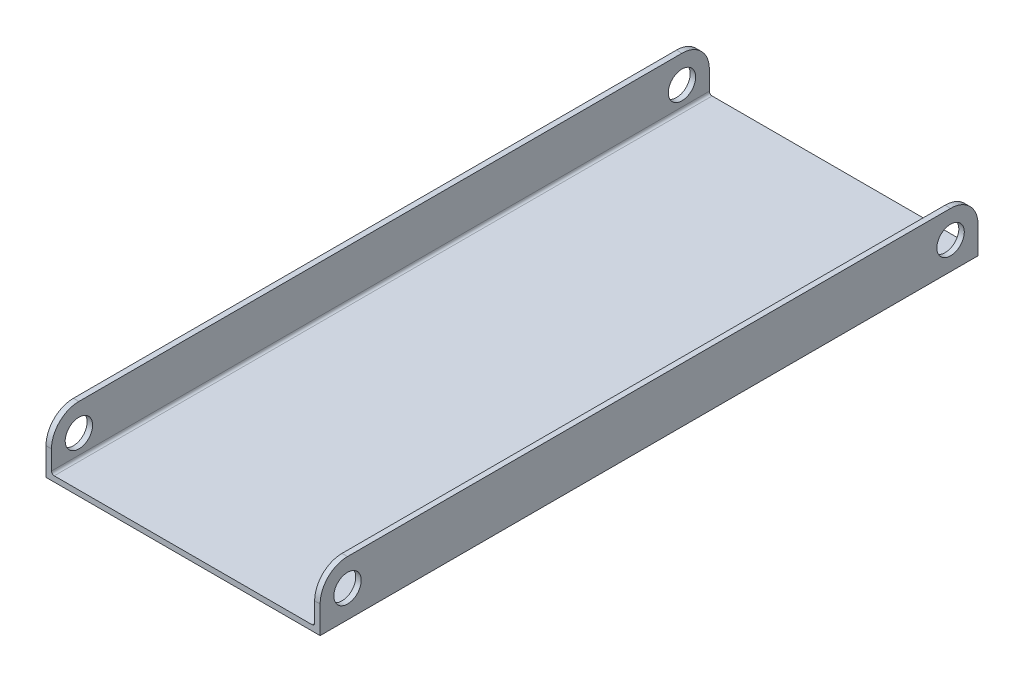
ISO-10303-21;
HEADER;
FILE_DESCRIPTION(('STEP AP214'),'2;1');
FILE_NAME('part.step','',(''),(''),'','','');
FILE_SCHEMA(('AUTOMOTIVE_DESIGN { 1 0 10303 214 1 1 1 1 }'));
ENDSEC;
DATA;
#1=APPLICATION_CONTEXT('core data for automotive mechanical design processes');
#2=APPLICATION_PROTOCOL_DEFINITION('international standard','automotive_design',2000,#1);
#3=PRODUCT_CONTEXT('',#1,'mechanical');
#4=PRODUCT('Part','Part','',(#3));
#5=PRODUCT_RELATED_PRODUCT_CATEGORY('part','',(#4));
#6=PRODUCT_DEFINITION_FORMATION('','',#4);
#7=PRODUCT_DEFINITION_CONTEXT('part definition',#1,'design');
#8=PRODUCT_DEFINITION('design','',#6,#7);
#9=PRODUCT_DEFINITION_SHAPE('','',#8);
#10=(LENGTH_UNIT() NAMED_UNIT(*) SI_UNIT(.MILLI.,.METRE.));
#11=(NAMED_UNIT(*) PLANE_ANGLE_UNIT() SI_UNIT($,.RADIAN.));
#12=(NAMED_UNIT(*) SI_UNIT($,.STERADIAN.) SOLID_ANGLE_UNIT());
#13=UNCERTAINTY_MEASURE_WITH_UNIT(LENGTH_MEASURE(1.E-05),#10,'distance_accuracy_value','');
#14=(GEOMETRIC_REPRESENTATION_CONTEXT(3) GLOBAL_UNCERTAINTY_ASSIGNED_CONTEXT((#13)) GLOBAL_UNIT_ASSIGNED_CONTEXT((#10,
#11,#12)) REPRESENTATION_CONTEXT('',''));
#15=CARTESIAN_POINT('',(0.,0.,0.));
#16=DIRECTION('',(0.,0.,1.));
#17=DIRECTION('',(1.,0.,0.));
#18=AXIS2_PLACEMENT_3D('',#15,#16,#17);
#19=CARTESIAN_POINT('',(-30.48,11.43,-152.4));
#20=DIRECTION('',(0.,1.,0.));
#21=DIRECTION('',(0.,0.,1.));
#22=AXIS2_PLACEMENT_3D('',#19,#20,#21);
#23=PLANE('',#22);
#24=DIRECTION('',(0.,0.,1.));
#25=VECTOR('',#24,1.);
#26=CARTESIAN_POINT('',(-30.48,11.43,-152.4));
#27=LINE('',#26,#25);
#28=CARTESIAN_POINT('',(-30.48,11.43,-146.05));
#29=VERTEX_POINT('',#28);
#30=CARTESIAN_POINT('',(-30.48,11.43,-6.35000000000005));
#31=VERTEX_POINT('',#30);
#32=EDGE_CURVE('E231',#29,#31,#27,.T.);
#33=ORIENTED_EDGE('',*,*,#32,.F.);
#34=DIRECTION('',(-1.,0.,0.));
#35=VECTOR('',#34,1.);
#36=CARTESIAN_POINT('',(-31.75,11.43,-146.05));
#37=LINE('',#36,#35);
#38=CARTESIAN_POINT('',(-31.75,11.43,-146.05));
#39=VERTEX_POINT('',#38);
#40=EDGE_CURVE('E288',#29,#39,#37,.T.);
#41=ORIENTED_EDGE('',*,*,#40,.T.);
#42=DIRECTION('',(0.,0.,1.));
#43=VECTOR('',#42,1.);
#44=CARTESIAN_POINT('',(-31.75,11.43,-152.4));
#45=LINE('',#44,#43);
#46=CARTESIAN_POINT('',(-31.75,11.43,-6.35000000000005));
#47=VERTEX_POINT('',#46);
#48=EDGE_CURVE('E172',#39,#47,#45,.T.);
#49=ORIENTED_EDGE('',*,*,#48,.T.);
#50=DIRECTION('',(-1.,0.,0.));
#51=VECTOR('',#50,1.);
#52=CARTESIAN_POINT('',(-30.48,11.43,-6.34999999999999));
#53=LINE('',#52,#51);
#54=EDGE_CURVE('E285',#47,#31,#53,.F.);
#55=ORIENTED_EDGE('',*,*,#54,.T.);
#56=EDGE_LOOP('',(#33,#41,#49,#55));
#57=FACE_BOUND('',#56,.T.);
#58=ADVANCED_FACE('F45',(#57),#23,.T.);
#59=CARTESIAN_POINT('',(-30.48,11.43,-152.4));
#60=DIRECTION('',(1.,0.,0.));
#61=DIRECTION('',(0.,0.,-1.));
#62=AXIS2_PLACEMENT_3D('',#59,#60,#61);
#63=PLANE('',#62);
#64=CARTESIAN_POINT('',(-30.48,5.07999999999997,-6.35));
#65=DIRECTION('',(1.,0.,0.));
#66=DIRECTION('',(0.,0.,-1.));
#67=AXIS2_PLACEMENT_3D('',#64,#65,#66);
#68=CIRCLE('',#67,3.175);
#69=CARTESIAN_POINT('',(-30.48,5.07999999999997,-9.525));
#70=VERTEX_POINT('',#69);
#71=EDGE_CURVE('E207',#70,#70,#68,.T.);
#72=ORIENTED_EDGE('',*,*,#71,.F.);
#73=EDGE_LOOP('',(#72));
#74=FACE_BOUND('',#73,.T.);
#75=CARTESIAN_POINT('',(-30.48,5.07999999999997,-146.05));
#76=DIRECTION('',(1.,0.,0.));
#77=DIRECTION('',(0.,0.,-1.));
#78=AXIS2_PLACEMENT_3D('',#75,#76,#77);
#79=CIRCLE('',#78,3.17500000000002);
#80=CARTESIAN_POINT('',(-30.48,5.07999999999997,-149.225));
#81=VERTEX_POINT('',#80);
#82=EDGE_CURVE('E414',#81,#81,#79,.T.);
#83=ORIENTED_EDGE('',*,*,#82,.F.);
#84=EDGE_LOOP('',(#83));
#85=FACE_BOUND('',#84,.T.);
#86=DIRECTION('',(0.,1.,0.));
#87=VECTOR('',#86,1.);
#88=CARTESIAN_POINT('',(-30.48,11.43,-152.4));
#89=LINE('',#88,#87);
#90=CARTESIAN_POINT('',(-30.48,0.635000000000005,-152.4));
#91=VERTEX_POINT('',#90);
#92=CARTESIAN_POINT('',(-30.48,5.08,-152.4));
#93=VERTEX_POINT('',#92);
#94=EDGE_CURVE('E200',#91,#93,#89,.T.);
#95=ORIENTED_EDGE('',*,*,#94,.T.);
#96=CARTESIAN_POINT('',(-30.48,5.08,-146.05));
#97=DIRECTION('',(1.,0.,0.));
#98=DIRECTION('',(0.,0.,-1.));
#99=AXIS2_PLACEMENT_3D('',#96,#97,#98);
#100=CIRCLE('',#99,6.35);
#101=EDGE_CURVE('E298',#93,#29,#100,.T.);
#102=ORIENTED_EDGE('',*,*,#101,.T.);
#103=ORIENTED_EDGE('',*,*,#32,.T.);
#104=CARTESIAN_POINT('',(-30.48,5.08,-6.35));
#105=DIRECTION('',(1.,0.,0.));
#106=DIRECTION('',(0.,0.,-1.));
#107=AXIS2_PLACEMENT_3D('',#104,#105,#106);
#108=CIRCLE('',#107,6.35);
#109=CARTESIAN_POINT('',(-30.48,5.08,0.));
#110=VERTEX_POINT('',#109);
#111=EDGE_CURVE('E61',#31,#110,#108,.T.);
#112=ORIENTED_EDGE('',*,*,#111,.T.);
#113=DIRECTION('',(0.,1.,0.));
#114=VECTOR('',#113,1.);
#115=CARTESIAN_POINT('',(-30.48,11.43,0.));
#116=LINE('',#115,#114);
#117=CARTESIAN_POINT('',(-30.48,0.635000000000005,0.));
#118=VERTEX_POINT('',#117);
#119=EDGE_CURVE('E163',#118,#110,#116,.T.);
#120=ORIENTED_EDGE('',*,*,#119,.F.);
#121=DIRECTION('',(0.,0.,1.));
#122=VECTOR('',#121,1.);
#123=CARTESIAN_POINT('',(-30.48,0.635000000000005,-152.4));
#124=LINE('',#123,#122);
#125=EDGE_CURVE('E235',#91,#118,#124,.T.);
#126=ORIENTED_EDGE('',*,*,#125,.F.);
#127=EDGE_LOOP('',(#95,#102,#103,#112,#120,#126));
#128=FACE_BOUND('',#127,.T.);
#129=ADVANCED_FACE('F321',(#74,#85,#128),#63,.T.);
#130=CARTESIAN_POINT('',(-29.845,0.635,-152.4));
#131=DIRECTION('',(0.,0.,1.));
#132=DIRECTION('',(1.,0.,0.));
#133=AXIS2_PLACEMENT_3D('',#130,#131,#132);
#134=CYLINDRICAL_SURFACE('',#133,0.635);
#135=CARTESIAN_POINT('',(-29.845,0.635,0.));
#136=DIRECTION('',(0.,0.,-1.));
#137=DIRECTION('',(1.,0.,0.));
#138=AXIS2_PLACEMENT_3D('',#135,#136,#137);
#139=CIRCLE('',#138,0.635);
#140=CARTESIAN_POINT('',(-29.845,0.,0.));
#141=VERTEX_POINT('',#140);
#142=EDGE_CURVE('E225',#141,#118,#139,.T.);
#143=ORIENTED_EDGE('',*,*,#142,.F.);
#144=DIRECTION('',(0.,0.,1.));
#145=VECTOR('',#144,1.);
#146=CARTESIAN_POINT('',(-29.845,0.,-152.4));
#147=LINE('',#146,#145);
#148=CARTESIAN_POINT('',(-29.845,0.,-152.4));
#149=VERTEX_POINT('',#148);
#150=EDGE_CURVE('E238',#149,#141,#147,.T.);
#151=ORIENTED_EDGE('',*,*,#150,.F.);
#152=CARTESIAN_POINT('',(-29.845,0.635,-152.4));
#153=DIRECTION('',(0.,0.,-1.));
#154=DIRECTION('',(1.,0.,0.));
#155=AXIS2_PLACEMENT_3D('',#152,#153,#154);
#156=CIRCLE('',#155,0.635);
#157=EDGE_CURVE('E196',#149,#91,#156,.T.);
#158=ORIENTED_EDGE('',*,*,#157,.T.);
#159=ORIENTED_EDGE('',*,*,#125,.T.);
#160=EDGE_LOOP('',(#143,#151,#158,#159));
#161=FACE_BOUND('',#160,.T.);
#162=ADVANCED_FACE('F327',(#161),#134,.F.);
#163=CARTESIAN_POINT('',(-29.845,0.,-152.4));
#164=DIRECTION('',(0.,1.,0.));
#165=DIRECTION('',(-1.,0.,0.));
#166=AXIS2_PLACEMENT_3D('',#163,#164,#165);
#167=PLANE('',#166);
#168=DIRECTION('',(-1.,0.,0.));
#169=VECTOR('',#168,1.);
#170=CARTESIAN_POINT('',(-29.845,0.,0.));
#171=LINE('',#170,#169);
#172=CARTESIAN_POINT('',(29.845,0.,0.));
#173=VERTEX_POINT('',#172);
#174=EDGE_CURVE('E221',#173,#141,#171,.T.);
#175=ORIENTED_EDGE('',*,*,#174,.F.);
#176=DIRECTION('',(0.,0.,1.));
#177=VECTOR('',#176,1.);
#178=CARTESIAN_POINT('',(29.845,0.,-152.4));
#179=LINE('',#178,#177);
#180=CARTESIAN_POINT('',(29.845,0.,-152.4));
#181=VERTEX_POINT('',#180);
#182=EDGE_CURVE('E241',#181,#173,#179,.T.);
#183=ORIENTED_EDGE('',*,*,#182,.F.);
#184=DIRECTION('',(-1.,0.,0.));
#185=VECTOR('',#184,1.);
#186=CARTESIAN_POINT('',(-29.845,0.,-152.4));
#187=LINE('',#186,#185);
#188=EDGE_CURVE('E192',#181,#149,#187,.T.);
#189=ORIENTED_EDGE('',*,*,#188,.T.);
#190=ORIENTED_EDGE('',*,*,#150,.T.);
#191=EDGE_LOOP('',(#175,#183,#189,#190));
#192=FACE_BOUND('',#191,.T.);
#193=ADVANCED_FACE('F349',(#192),#167,.T.);
#194=CARTESIAN_POINT('',(29.845,0.635000000000011,-152.4));
#195=DIRECTION('',(0.,0.,1.));
#196=DIRECTION('',(1.,0.,0.));
#197=AXIS2_PLACEMENT_3D('',#194,#195,#196);
#198=CYLINDRICAL_SURFACE('',#197,0.635);
#199=CARTESIAN_POINT('',(29.845,0.635000000000011,0.));
#200=DIRECTION('',(0.,0.,-1.));
#201=DIRECTION('',(1.,0.,0.));
#202=AXIS2_PLACEMENT_3D('',#199,#200,#201);
#203=CIRCLE('',#202,0.635);
#204=CARTESIAN_POINT('',(30.48,0.635000000000011,0.));
#205=VERTEX_POINT('',#204);
#206=EDGE_CURVE('E217',#205,#173,#203,.T.);
#207=ORIENTED_EDGE('',*,*,#206,.F.);
#208=DIRECTION('',(0.,0.,1.));
#209=VECTOR('',#208,1.);
#210=CARTESIAN_POINT('',(30.48,0.635000000000011,-152.4));
#211=LINE('',#210,#209);
#212=CARTESIAN_POINT('',(30.48,0.635000000000011,-152.4));
#213=VERTEX_POINT('',#212);
#214=EDGE_CURVE('E244',#213,#205,#211,.T.);
#215=ORIENTED_EDGE('',*,*,#214,.F.);
#216=CARTESIAN_POINT('',(29.845,0.635000000000011,-152.4));
#217=DIRECTION('',(0.,0.,-1.));
#218=DIRECTION('',(1.,0.,0.));
#219=AXIS2_PLACEMENT_3D('',#216,#217,#218);
#220=CIRCLE('',#219,0.635);
#221=EDGE_CURVE('E188',#213,#181,#220,.T.);
#222=ORIENTED_EDGE('',*,*,#221,.T.);
#223=ORIENTED_EDGE('',*,*,#182,.T.);
#224=EDGE_LOOP('',(#207,#215,#222,#223));
#225=FACE_BOUND('',#224,.T.);
#226=ADVANCED_FACE('F353',(#225),#198,.F.);
#227=CARTESIAN_POINT('',(30.48,0.635000000000016,-152.4));
#228=DIRECTION('',(-1.,0.,0.));
#229=DIRECTION('',(0.,-1.,0.));
#230=AXIS2_PLACEMENT_3D('',#227,#228,#229);
#231=PLANE('',#230);
#232=CARTESIAN_POINT('',(30.48,5.08,-6.35));
#233=DIRECTION('',(-1.,0.,0.));
#234=DIRECTION('',(0.,-1.,0.));
#235=AXIS2_PLACEMENT_3D('',#232,#233,#234);
#236=CIRCLE('',#235,3.175);
#237=CARTESIAN_POINT('',(30.48,1.905,-6.35));
#238=VERTEX_POINT('',#237);
#239=EDGE_CURVE('E418',#238,#238,#236,.T.);
#240=ORIENTED_EDGE('',*,*,#239,.F.);
#241=EDGE_LOOP('',(#240));
#242=FACE_BOUND('',#241,.T.);
#243=CARTESIAN_POINT('',(30.48,5.08,-146.05));
#244=DIRECTION('',(-1.,0.,0.));
#245=DIRECTION('',(0.,-1.,0.));
#246=AXIS2_PLACEMENT_3D('',#243,#244,#245);
#247=CIRCLE('',#246,3.17500000000002);
#248=CARTESIAN_POINT('',(30.48,1.90499999999997,-146.05));
#249=VERTEX_POINT('',#248);
#250=EDGE_CURVE('E410',#249,#249,#247,.T.);
#251=ORIENTED_EDGE('',*,*,#250,.F.);
#252=EDGE_LOOP('',(#251));
#253=FACE_BOUND('',#252,.T.);
#254=DIRECTION('',(0.,0.,1.));
#255=VECTOR('',#254,1.);
#256=CARTESIAN_POINT('',(30.48,11.43,-152.4));
#257=LINE('',#256,#255);
#258=CARTESIAN_POINT('',(30.48,11.43,-146.05));
#259=VERTEX_POINT('',#258);
#260=CARTESIAN_POINT('',(30.48,11.43,-6.35000000000005));
#261=VERTEX_POINT('',#260);
#262=EDGE_CURVE('E248',#259,#261,#257,.T.);
#263=ORIENTED_EDGE('',*,*,#262,.F.);
#264=CARTESIAN_POINT('',(30.48,5.08000000000001,-146.05));
#265=DIRECTION('',(-1.,0.,0.));
#266=DIRECTION('',(0.,-1.,0.));
#267=AXIS2_PLACEMENT_3D('',#264,#265,#266);
#268=CIRCLE('',#267,6.35);
#269=CARTESIAN_POINT('',(30.48,5.08000000000001,-152.4));
#270=VERTEX_POINT('',#269);
#271=EDGE_CURVE('E270',#259,#270,#268,.T.);
#272=ORIENTED_EDGE('',*,*,#271,.T.);
#273=DIRECTION('',(0.,-1.,0.));
#274=VECTOR('',#273,1.);
#275=CARTESIAN_POINT('',(30.48,0.635000000000016,-152.4));
#276=LINE('',#275,#274);
#277=EDGE_CURVE('E182',#270,#213,#276,.T.);
#278=ORIENTED_EDGE('',*,*,#277,.T.);
#279=ORIENTED_EDGE('',*,*,#214,.T.);
#280=DIRECTION('',(0.,-1.,0.));
#281=VECTOR('',#280,1.);
#282=CARTESIAN_POINT('',(30.48,0.635000000000016,0.));
#283=LINE('',#282,#281);
#284=CARTESIAN_POINT('',(30.48,5.08000000000001,0.));
#285=VERTEX_POINT('',#284);
#286=EDGE_CURVE('E214',#285,#205,#283,.T.);
#287=ORIENTED_EDGE('',*,*,#286,.F.);
#288=CARTESIAN_POINT('',(30.48,5.08000000000001,-6.35));
#289=DIRECTION('',(-1.,0.,0.));
#290=DIRECTION('',(0.,-1.,0.));
#291=AXIS2_PLACEMENT_3D('',#288,#289,#290);
#292=CIRCLE('',#291,6.35);
#293=EDGE_CURVE('E267',#285,#261,#292,.T.);
#294=ORIENTED_EDGE('',*,*,#293,.T.);
#295=EDGE_LOOP('',(#263,#272,#278,#279,#287,#294));
#296=FACE_BOUND('',#295,.T.);
#297=ADVANCED_FACE('F370',(#242,#253,#296),#231,.T.);
#298=CARTESIAN_POINT('',(30.48,11.43,-152.4));
#299=DIRECTION('',(0.,1.,0.));
#300=DIRECTION('',(0.,0.,1.));
#301=AXIS2_PLACEMENT_3D('',#298,#299,#300);
#302=PLANE('',#301);
#303=DIRECTION('',(0.,0.,1.));
#304=VECTOR('',#303,1.);
#305=CARTESIAN_POINT('',(31.75,11.43,-152.4));
#306=LINE('',#305,#304);
#307=CARTESIAN_POINT('',(31.75,11.43,-146.05));
#308=VERTEX_POINT('',#307);
#309=CARTESIAN_POINT('',(31.75,11.43,-6.35000000000005));
#310=VERTEX_POINT('',#309);
#311=EDGE_CURVE('E252',#308,#310,#306,.T.);
#312=ORIENTED_EDGE('',*,*,#311,.F.);
#313=DIRECTION('',(-1.,0.,0.));
#314=VECTOR('',#313,1.);
#315=CARTESIAN_POINT('',(30.48,11.43,-146.05));
#316=LINE('',#315,#314);
#317=EDGE_CURVE('E263',#308,#259,#316,.T.);
#318=ORIENTED_EDGE('',*,*,#317,.T.);
#319=ORIENTED_EDGE('',*,*,#262,.T.);
#320=DIRECTION('',(-1.,0.,0.));
#321=VECTOR('',#320,1.);
#322=CARTESIAN_POINT('',(30.48,11.43,-6.34999999999999));
#323=LINE('',#322,#321);
#324=EDGE_CURVE('E234',#261,#310,#323,.F.);
#325=ORIENTED_EDGE('',*,*,#324,.T.);
#326=EDGE_LOOP('',(#312,#318,#319,#325));
#327=FACE_BOUND('',#326,.T.);
#328=ADVANCED_FACE('F364',(#327),#302,.T.);
#329=CARTESIAN_POINT('',(31.75,-1.27,-152.4));
#330=DIRECTION('',(1.,0.,0.));
#331=DIRECTION('',(0.,1.,0.));
#332=AXIS2_PLACEMENT_3D('',#329,#330,#331);
#333=PLANE('',#332);
#334=CARTESIAN_POINT('',(31.75,5.08,-6.35));
#335=DIRECTION('',(1.,0.,0.));
#336=DIRECTION('',(0.,1.,0.));
#337=AXIS2_PLACEMENT_3D('',#334,#335,#336);
#338=CIRCLE('',#337,3.175);
#339=CARTESIAN_POINT('',(31.75,8.255,-6.35));
#340=VERTEX_POINT('',#339);
#341=EDGE_CURVE('E406',#340,#340,#338,.T.);
#342=ORIENTED_EDGE('',*,*,#341,.F.);
#343=EDGE_LOOP('',(#342));
#344=FACE_BOUND('',#343,.T.);
#345=CARTESIAN_POINT('',(31.75,5.08,-146.05));
#346=DIRECTION('',(1.,0.,0.));
#347=DIRECTION('',(0.,-1.,0.));
#348=AXIS2_PLACEMENT_3D('',#345,#346,#347);
#349=CIRCLE('',#348,3.17500000000002);
#350=CARTESIAN_POINT('',(31.75,1.90499999999998,-146.05));
#351=VERTEX_POINT('',#350);
#352=EDGE_CURVE('E402',#351,#351,#349,.T.);
#353=ORIENTED_EDGE('',*,*,#352,.F.);
#354=EDGE_LOOP('',(#353));
#355=FACE_BOUND('',#354,.T.);
#356=DIRECTION('',(0.,1.,0.));
#357=VECTOR('',#356,1.);
#358=CARTESIAN_POINT('',(31.75,-1.27,-152.4));
#359=LINE('',#358,#357);
#360=CARTESIAN_POINT('',(31.75,-1.27,-152.4));
#361=VERTEX_POINT('',#360);
#362=CARTESIAN_POINT('',(31.75,5.08000000000001,-152.4));
#363=VERTEX_POINT('',#362);
#364=EDGE_CURVE('E178',#361,#363,#359,.T.);
#365=ORIENTED_EDGE('',*,*,#364,.T.);
#366=CARTESIAN_POINT('',(31.75,5.08000000000001,-146.05));
#367=DIRECTION('',(1.,0.,0.));
#368=DIRECTION('',(0.,1.,0.));
#369=AXIS2_PLACEMENT_3D('',#366,#367,#368);
#370=CIRCLE('',#369,6.35);
#371=EDGE_CURVE('E282',#363,#308,#370,.T.);
#372=ORIENTED_EDGE('',*,*,#371,.T.);
#373=ORIENTED_EDGE('',*,*,#311,.T.);
#374=CARTESIAN_POINT('',(31.75,5.08000000000001,-6.35));
#375=DIRECTION('',(1.,0.,0.));
#376=DIRECTION('',(0.,1.,0.));
#377=AXIS2_PLACEMENT_3D('',#374,#375,#376);
#378=CIRCLE('',#377,6.35);
#379=CARTESIAN_POINT('',(31.75,5.08000000000001,0.));
#380=VERTEX_POINT('',#379);
#381=EDGE_CURVE('E279',#310,#380,#378,.T.);
#382=ORIENTED_EDGE('',*,*,#381,.T.);
#383=DIRECTION('',(0.,1.,0.));
#384=VECTOR('',#383,1.);
#385=CARTESIAN_POINT('',(31.75,-1.27,0.));
#386=LINE('',#385,#384);
#387=CARTESIAN_POINT('',(31.75,-1.27,0.));
#388=VERTEX_POINT('',#387);
#389=EDGE_CURVE('E210',#388,#380,#386,.T.);
#390=ORIENTED_EDGE('',*,*,#389,.F.);
#391=DIRECTION('',(0.,0.,1.));
#392=VECTOR('',#391,1.);
#393=CARTESIAN_POINT('',(31.75,-1.27,-152.4));
#394=LINE('',#393,#392);
#395=EDGE_CURVE('E171',#361,#388,#394,.T.);
#396=ORIENTED_EDGE('',*,*,#395,.F.);
#397=EDGE_LOOP('',(#365,#372,#373,#382,#390,#396));
#398=FACE_BOUND('',#397,.T.);
#399=ADVANCED_FACE('F361',(#344,#355,#398),#333,.T.);
#400=CARTESIAN_POINT('',(-31.75,-1.27,-152.4));
#401=DIRECTION('',(0.,-1.,0.));
#402=DIRECTION('',(0.,0.,-1.));
#403=AXIS2_PLACEMENT_3D('',#400,#401,#402);
#404=PLANE('',#403);
#405=DIRECTION('',(1.,0.,0.));
#406=VECTOR('',#405,1.);
#407=CARTESIAN_POINT('',(-31.75,-1.27,0.));
#408=LINE('',#407,#406);
#409=CARTESIAN_POINT('',(-31.75,-1.27,0.));
#410=VERTEX_POINT('',#409);
#411=EDGE_CURVE('E169',#410,#388,#408,.T.);
#412=ORIENTED_EDGE('',*,*,#411,.F.);
#413=DIRECTION('',(0.,0.,1.));
#414=VECTOR('',#413,1.);
#415=CARTESIAN_POINT('',(-31.75,-1.27,-152.4));
#416=LINE('',#415,#414);
#417=CARTESIAN_POINT('',(-31.75,-1.27,-152.4));
#418=VERTEX_POINT('',#417);
#419=EDGE_CURVE('E155',#418,#410,#416,.T.);
#420=ORIENTED_EDGE('',*,*,#419,.F.);
#421=DIRECTION('',(1.,0.,0.));
#422=VECTOR('',#421,1.);
#423=CARTESIAN_POINT('',(-31.75,-1.27,-152.4));
#424=LINE('',#423,#422);
#425=EDGE_CURVE('E162',#418,#361,#424,.T.);
#426=ORIENTED_EDGE('',*,*,#425,.T.);
#427=ORIENTED_EDGE('',*,*,#395,.T.);
#428=EDGE_LOOP('',(#412,#420,#426,#427));
#429=FACE_BOUND('',#428,.T.);
#430=ADVANCED_FACE('F167',(#429),#404,.T.);
#431=CARTESIAN_POINT('',(-31.75,11.43,-152.4));
#432=DIRECTION('',(-1.,0.,0.));
#433=DIRECTION('',(0.,0.,1.));
#434=AXIS2_PLACEMENT_3D('',#431,#432,#433);
#435=PLANE('',#434);
#436=CARTESIAN_POINT('',(-31.75,5.07999999999996,-6.35));
#437=DIRECTION('',(1.,0.,0.));
#438=DIRECTION('',(0.,1.,0.));
#439=AXIS2_PLACEMENT_3D('',#436,#437,#438);
#440=CIRCLE('',#439,3.175);
#441=CARTESIAN_POINT('',(-31.75,8.25499999999996,-6.35));
#442=VERTEX_POINT('',#441);
#443=EDGE_CURVE('E396',#442,#442,#440,.T.);
#444=ORIENTED_EDGE('',*,*,#443,.T.);
#445=EDGE_LOOP('',(#444));
#446=FACE_BOUND('',#445,.T.);
#447=CARTESIAN_POINT('',(-31.75,5.07999999999996,-146.05));
#448=DIRECTION('',(1.,0.,0.));
#449=DIRECTION('',(0.,-1.,0.));
#450=AXIS2_PLACEMENT_3D('',#447,#448,#449);
#451=CIRCLE('',#450,3.17500000000002);
#452=CARTESIAN_POINT('',(-31.75,1.90499999999994,-146.05));
#453=VERTEX_POINT('',#452);
#454=EDGE_CURVE('E399',#453,#453,#451,.T.);
#455=ORIENTED_EDGE('',*,*,#454,.T.);
#456=EDGE_LOOP('',(#455));
#457=FACE_BOUND('',#456,.T.);
#458=ORIENTED_EDGE('',*,*,#48,.F.);
#459=CARTESIAN_POINT('',(-31.75,5.08,-146.05));
#460=DIRECTION('',(-1.,0.,0.));
#461=DIRECTION('',(0.,0.,1.));
#462=AXIS2_PLACEMENT_3D('',#459,#460,#461);
#463=CIRCLE('',#462,6.35);
#464=CARTESIAN_POINT('',(-31.75,5.08,-152.4));
#465=VERTEX_POINT('',#464);
#466=EDGE_CURVE('E157',#39,#465,#463,.T.);
#467=ORIENTED_EDGE('',*,*,#466,.T.);
#468=DIRECTION('',(0.,-1.,0.));
#469=VECTOR('',#468,1.);
#470=CARTESIAN_POINT('',(-31.75,11.43,-152.4));
#471=LINE('',#470,#469);
#472=EDGE_CURVE('E150',#465,#418,#471,.T.);
#473=ORIENTED_EDGE('',*,*,#472,.T.);
#474=ORIENTED_EDGE('',*,*,#419,.T.);
#475=DIRECTION('',(0.,-1.,0.));
#476=VECTOR('',#475,1.);
#477=CARTESIAN_POINT('',(-31.75,11.43,0.));
#478=LINE('',#477,#476);
#479=CARTESIAN_POINT('',(-31.75,5.08,0.));
#480=VERTEX_POINT('',#479);
#481=EDGE_CURVE('E204',#480,#410,#478,.T.);
#482=ORIENTED_EDGE('',*,*,#481,.F.);
#483=CARTESIAN_POINT('',(-31.75,5.08,-6.35));
#484=DIRECTION('',(-1.,0.,0.));
#485=DIRECTION('',(0.,0.,1.));
#486=AXIS2_PLACEMENT_3D('',#483,#484,#485);
#487=CIRCLE('',#486,6.35);
#488=EDGE_CURVE('E69',#480,#47,#487,.T.);
#489=ORIENTED_EDGE('',*,*,#488,.T.);
#490=EDGE_LOOP('',(#458,#467,#473,#474,#482,#489));
#491=FACE_BOUND('',#490,.T.);
#492=ADVANCED_FACE('F153',(#446,#457,#491),#435,.T.);
#493=CARTESIAN_POINT('',(29.845,0.635000000000011,-152.4));
#494=DIRECTION('',(0.,0.,1.));
#495=DIRECTION('',(1.,0.,0.));
#496=AXIS2_PLACEMENT_3D('',#493,#494,#495);
#497=PLANE('',#496);
#498=ORIENTED_EDGE('',*,*,#277,.F.);
#499=DIRECTION('',(-1.,0.,0.));
#500=VECTOR('',#499,1.);
#501=CARTESIAN_POINT('',(31.75,5.08000000000001,-152.4));
#502=LINE('',#501,#500);
#503=EDGE_CURVE('E276',#270,#363,#502,.F.);
#504=ORIENTED_EDGE('',*,*,#503,.T.);
#505=ORIENTED_EDGE('',*,*,#364,.F.);
#506=ORIENTED_EDGE('',*,*,#425,.F.);
#507=ORIENTED_EDGE('',*,*,#472,.F.);
#508=DIRECTION('',(-1.,0.,0.));
#509=VECTOR('',#508,1.);
#510=CARTESIAN_POINT('',(-30.48,5.08,-152.4));
#511=LINE('',#510,#509);
#512=EDGE_CURVE('E273',#465,#93,#511,.F.);
#513=ORIENTED_EDGE('',*,*,#512,.T.);
#514=ORIENTED_EDGE('',*,*,#94,.F.);
#515=ORIENTED_EDGE('',*,*,#157,.F.);
#516=ORIENTED_EDGE('',*,*,#188,.F.);
#517=ORIENTED_EDGE('',*,*,#221,.F.);
#518=EDGE_LOOP('',(#498,#504,#505,#506,#507,#513,#514,#515,#516,#517));
#519=FACE_BOUND('',#518,.T.);
#520=ADVANCED_FACE('F176',(#519),#497,.F.);
#521=CARTESIAN_POINT('',(29.845,0.635000000000011,0.));
#522=DIRECTION('',(0.,0.,1.));
#523=DIRECTION('',(1.,0.,0.));
#524=AXIS2_PLACEMENT_3D('',#521,#522,#523);
#525=PLANE('',#524);
#526=ORIENTED_EDGE('',*,*,#389,.T.);
#527=DIRECTION('',(-1.,0.,0.));
#528=VECTOR('',#527,1.);
#529=CARTESIAN_POINT('',(29.845,5.08000000000001,0.));
#530=LINE('',#529,#528);
#531=EDGE_CURVE('E11',#380,#285,#530,.T.);
#532=ORIENTED_EDGE('',*,*,#531,.T.);
#533=ORIENTED_EDGE('',*,*,#286,.T.);
#534=ORIENTED_EDGE('',*,*,#206,.T.);
#535=ORIENTED_EDGE('',*,*,#174,.T.);
#536=ORIENTED_EDGE('',*,*,#142,.T.);
#537=ORIENTED_EDGE('',*,*,#119,.T.);
#538=DIRECTION('',(-1.,0.,0.));
#539=VECTOR('',#538,1.);
#540=CARTESIAN_POINT('',(29.845,5.08,0.));
#541=LINE('',#540,#539);
#542=EDGE_CURVE('E54',#110,#480,#541,.T.);
#543=ORIENTED_EDGE('',*,*,#542,.T.);
#544=ORIENTED_EDGE('',*,*,#481,.T.);
#545=ORIENTED_EDGE('',*,*,#411,.T.);
#546=EDGE_LOOP('',(#526,#532,#533,#534,#535,#536,#537,#543,#544,#545));
#547=FACE_BOUND('',#546,.T.);
#548=ADVANCED_FACE('F302',(#547),#525,.T.);
#549=CARTESIAN_POINT('',(30.48,5.08000000000001,-146.05));
#550=DIRECTION('',(1.,0.,0.));
#551=DIRECTION('',(0.,0.,-1.));
#552=AXIS2_PLACEMENT_3D('',#549,#550,#551);
#553=CYLINDRICAL_SURFACE('',#552,6.35);
#554=ORIENTED_EDGE('',*,*,#371,.F.);
#555=ORIENTED_EDGE('',*,*,#503,.F.);
#556=ORIENTED_EDGE('',*,*,#271,.F.);
#557=ORIENTED_EDGE('',*,*,#317,.F.);
#558=EDGE_LOOP('',(#554,#555,#556,#557));
#559=FACE_BOUND('',#558,.T.);
#560=ADVANCED_FACE('F333',(#559),#553,.T.);
#561=CARTESIAN_POINT('',(-30.48,5.08,-146.05));
#562=DIRECTION('',(1.,0.,0.));
#563=DIRECTION('',(0.,0.,-1.));
#564=AXIS2_PLACEMENT_3D('',#561,#562,#563);
#565=CYLINDRICAL_SURFACE('',#564,6.35);
#566=ORIENTED_EDGE('',*,*,#101,.F.);
#567=ORIENTED_EDGE('',*,*,#512,.F.);
#568=ORIENTED_EDGE('',*,*,#466,.F.);
#569=ORIENTED_EDGE('',*,*,#40,.F.);
#570=EDGE_LOOP('',(#566,#567,#568,#569));
#571=FACE_BOUND('',#570,.T.);
#572=ADVANCED_FACE('F318',(#571),#565,.T.);
#573=CARTESIAN_POINT('',(29.845,5.08000000000001,-6.35));
#574=DIRECTION('',(-1.,0.,0.));
#575=DIRECTION('',(0.,0.,1.));
#576=AXIS2_PLACEMENT_3D('',#573,#574,#575);
#577=CYLINDRICAL_SURFACE('',#576,6.35);
#578=ORIENTED_EDGE('',*,*,#381,.F.);
#579=ORIENTED_EDGE('',*,*,#324,.F.);
#580=ORIENTED_EDGE('',*,*,#293,.F.);
#581=ORIENTED_EDGE('',*,*,#531,.F.);
#582=EDGE_LOOP('',(#578,#579,#580,#581));
#583=FACE_BOUND('',#582,.T.);
#584=ADVANCED_FACE('F308',(#583),#577,.T.);
#585=CARTESIAN_POINT('',(29.845,5.08,-6.35));
#586=DIRECTION('',(-1.,0.,0.));
#587=DIRECTION('',(0.,0.,1.));
#588=AXIS2_PLACEMENT_3D('',#585,#586,#587);
#589=CYLINDRICAL_SURFACE('',#588,6.35);
#590=ORIENTED_EDGE('',*,*,#111,.F.);
#591=ORIENTED_EDGE('',*,*,#54,.F.);
#592=ORIENTED_EDGE('',*,*,#488,.F.);
#593=ORIENTED_EDGE('',*,*,#542,.F.);
#594=EDGE_LOOP('',(#590,#591,#592,#593));
#595=FACE_BOUND('',#594,.T.);
#596=ADVANCED_FACE('F47',(#595),#589,.T.);
#597=CARTESIAN_POINT('',(-31.75,5.07999999999996,-146.05));
#598=DIRECTION('',(1.,0.,0.));
#599=DIRECTION('',(0.,1.,0.));
#600=AXIS2_PLACEMENT_3D('',#597,#598,#599);
#601=CYLINDRICAL_SURFACE('',#600,3.17500000000002);
#602=ORIENTED_EDGE('',*,*,#82,.T.);
#603=EDGE_LOOP('',(#602));
#604=FACE_BOUND('',#603,.T.);
#605=ORIENTED_EDGE('',*,*,#454,.F.);
#606=EDGE_LOOP('',(#605));
#607=FACE_BOUND('',#606,.T.);
#608=ADVANCED_FACE('F307',(#604,#607),#601,.F.);
#609=CARTESIAN_POINT('',(-31.75,5.07999999999996,-6.35));
#610=DIRECTION('',(1.,0.,0.));
#611=DIRECTION('',(0.,1.,0.));
#612=AXIS2_PLACEMENT_3D('',#609,#610,#611);
#613=CYLINDRICAL_SURFACE('',#612,3.175);
#614=ORIENTED_EDGE('',*,*,#71,.T.);
#615=EDGE_LOOP('',(#614));
#616=FACE_BOUND('',#615,.T.);
#617=ORIENTED_EDGE('',*,*,#443,.F.);
#618=EDGE_LOOP('',(#617));
#619=FACE_BOUND('',#618,.T.);
#620=ADVANCED_FACE('F314',(#616,#619),#613,.F.);
#621=ORIENTED_EDGE('',*,*,#250,.T.);
#622=EDGE_LOOP('',(#621));
#623=FACE_BOUND('',#622,.T.);
#624=ORIENTED_EDGE('',*,*,#352,.T.);
#625=EDGE_LOOP('',(#624));
#626=FACE_BOUND('',#625,.T.);
#627=ADVANCED_FACE('F317',(#623,#626),#601,.F.);
#628=ORIENTED_EDGE('',*,*,#239,.T.);
#629=EDGE_LOOP('',(#628));
#630=FACE_BOUND('',#629,.T.);
#631=ORIENTED_EDGE('',*,*,#341,.T.);
#632=EDGE_LOOP('',(#631));
#633=FACE_BOUND('',#632,.T.);
#634=ADVANCED_FACE('F430',(#630,#633),#613,.F.);
#635=CLOSED_SHELL('',(#58,#129,#162,#193,#226,#297,#328,#399,#430,#492,#520,#548,#560,#572,#584,
#596,#608,#620,#627,#634));
#636=MANIFOLD_SOLID_BREP('B2',#635);
#637=ADVANCED_BREP_SHAPE_REPRESENTATION('',(#18,#636),#14);
#638=SHAPE_DEFINITION_REPRESENTATION(#9,#637);
ENDSEC;
END-ISO-10303-21;
